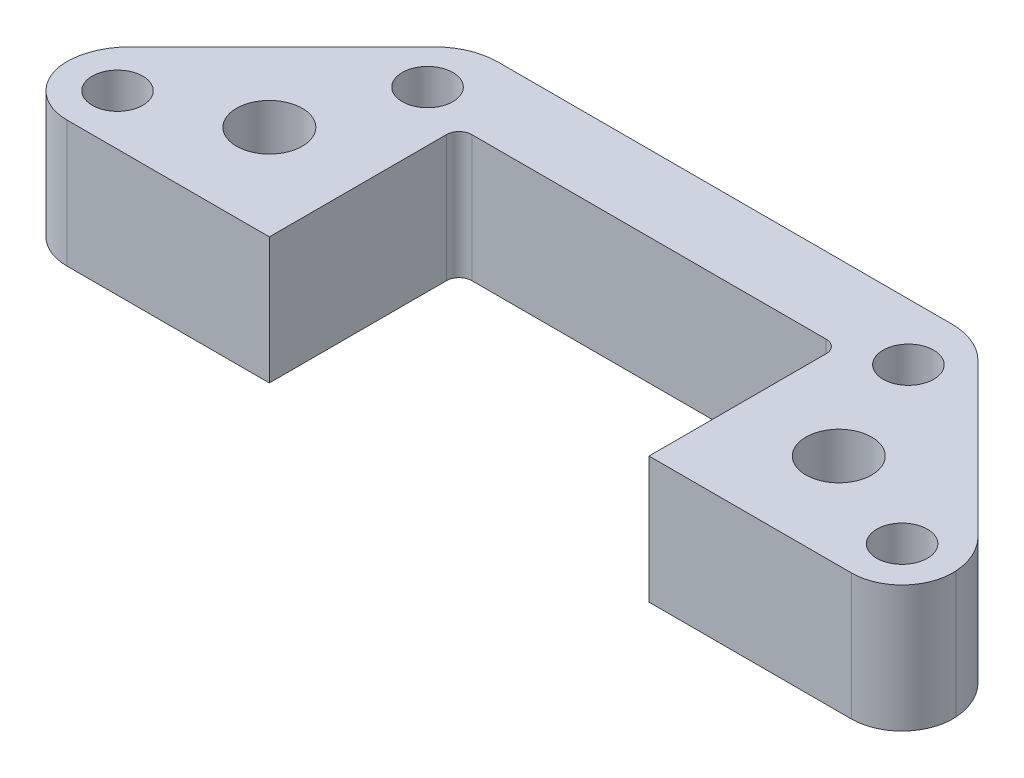
ISO-10303-21;
HEADER;
FILE_DESCRIPTION(('STEP AP214'),'2;1');
FILE_NAME('part.step','',(''),(''),'','','');
FILE_SCHEMA(('AUTOMOTIVE_DESIGN { 1 0 10303 214 1 1 1 1 }'));
ENDSEC;
DATA;
#1=APPLICATION_CONTEXT('core data for automotive mechanical design processes');
#2=APPLICATION_PROTOCOL_DEFINITION('international standard','automotive_design',2000,#1);
#3=PRODUCT_CONTEXT('',#1,'mechanical');
#4=PRODUCT('Part','Part','',(#3));
#5=PRODUCT_RELATED_PRODUCT_CATEGORY('part','',(#4));
#6=PRODUCT_DEFINITION_FORMATION('','',#4);
#7=PRODUCT_DEFINITION_CONTEXT('part definition',#1,'design');
#8=PRODUCT_DEFINITION('design','',#6,#7);
#9=PRODUCT_DEFINITION_SHAPE('','',#8);
#10=(LENGTH_UNIT() NAMED_UNIT(*) SI_UNIT(.MILLI.,.METRE.));
#11=(NAMED_UNIT(*) PLANE_ANGLE_UNIT() SI_UNIT($,.RADIAN.));
#12=(NAMED_UNIT(*) SI_UNIT($,.STERADIAN.) SOLID_ANGLE_UNIT());
#13=UNCERTAINTY_MEASURE_WITH_UNIT(LENGTH_MEASURE(1.E-05),#10,'distance_accuracy_value','');
#14=(GEOMETRIC_REPRESENTATION_CONTEXT(3) GLOBAL_UNCERTAINTY_ASSIGNED_CONTEXT((#13)) GLOBAL_UNIT_ASSIGNED_CONTEXT((#10,
#11,#12)) REPRESENTATION_CONTEXT('',''));
#15=CARTESIAN_POINT('',(0.,0.,0.));
#16=DIRECTION('',(0.,0.,1.));
#17=DIRECTION('',(1.,0.,0.));
#18=AXIS2_PLACEMENT_3D('',#15,#16,#17);
#19=CARTESIAN_POINT('',(22.5,10.,-7.5));
#20=DIRECTION('',(0.,-1.,0.));
#21=DIRECTION('',(0.,0.,-1.));
#22=AXIS2_PLACEMENT_3D('',#19,#20,#21);
#23=CYLINDRICAL_SURFACE('',#22,2.6);
#24=CARTESIAN_POINT('',(22.5,10.,-7.5));
#25=DIRECTION('',(0.,1.,0.));
#26=DIRECTION('',(0.,0.,1.));
#27=AXIS2_PLACEMENT_3D('',#24,#25,#26);
#28=CIRCLE('',#27,2.6);
#29=CARTESIAN_POINT('',(22.5,10.,-4.9));
#30=VERTEX_POINT('',#29);
#31=EDGE_CURVE('E220',#30,#30,#28,.T.);
#32=ORIENTED_EDGE('',*,*,#31,.T.);
#33=EDGE_LOOP('',(#32));
#34=FACE_BOUND('',#33,.T.);
#35=CARTESIAN_POINT('',(22.5,5.4,-7.5));
#36=DIRECTION('',(0.,-1.,0.));
#37=DIRECTION('',(0.,0.,-1.));
#38=AXIS2_PLACEMENT_3D('',#35,#36,#37);
#39=CIRCLE('',#38,2.6);
#40=CARTESIAN_POINT('',(22.5,5.4,-10.1));
#41=VERTEX_POINT('',#40);
#42=EDGE_CURVE('E213',#41,#41,#39,.T.);
#43=ORIENTED_EDGE('',*,*,#42,.T.);
#44=EDGE_LOOP('',(#43));
#45=FACE_BOUND('',#44,.T.);
#46=ADVANCED_FACE('F41',(#34,#45),#23,.F.);
#47=CARTESIAN_POINT('',(0.,10.,0.));
#48=DIRECTION('',(0.,1.,0.));
#49=DIRECTION('',(0.,0.,1.));
#50=AXIS2_PLACEMENT_3D('',#47,#48,#49);
#51=PLANE('',#50);
#52=DIRECTION('',(1.,0.,0.));
#53=VECTOR('',#52,1.);
#54=CARTESIAN_POINT('',(15.,10.,0.));
#55=LINE('',#54,#53);
#56=CARTESIAN_POINT('',(15.,10.,0.));
#57=VERTEX_POINT('',#56);
#58=CARTESIAN_POINT('',(30.9974714863677,10.,0.));
#59=VERTEX_POINT('',#58);
#60=EDGE_CURVE('E282',#57,#59,#55,.T.);
#61=ORIENTED_EDGE('',*,*,#60,.T.);
#62=CARTESIAN_POINT('',(30.9974714863677,10.,-4.00000000000001));
#63=DIRECTION('',(0.,1.,0.));
#64=DIRECTION('',(0.,0.,1.));
#65=AXIS2_PLACEMENT_3D('',#62,#63,#64);
#66=CIRCLE('',#65,4.);
#67=CARTESIAN_POINT('',(34.9873574318387,10.,-4.28427124746191));
#68=VERTEX_POINT('',#67);
#69=EDGE_CURVE('E261',#59,#68,#66,.T.);
#70=ORIENTED_EDGE('',*,*,#69,.T.);
#71=CARTESIAN_POINT('',(30.,10.,-3.92893218813454));
#72=DIRECTION('',(0.,1.,0.));
#73=DIRECTION('',(0.,0.,1.));
#74=AXIS2_PLACEMENT_3D('',#71,#72,#73);
#75=CIRCLE('',#74,5.);
#76=CARTESIAN_POINT('',(33.5355339059327,10.,-7.46446609406727));
#77=VERTEX_POINT('',#76);
#78=EDGE_CURVE('E239',#68,#77,#75,.T.);
#79=ORIENTED_EDGE('',*,*,#78,.T.);
#80=DIRECTION('',(-0.707106781186548,0.,-0.707106781186547));
#81=VECTOR('',#80,1.);
#82=CARTESIAN_POINT('',(20.,10.,-21.));
#83=LINE('',#82,#81);
#84=CARTESIAN_POINT('',(21.4644660940673,10.,-19.5355339059327));
#85=VERTEX_POINT('',#84);
#86=EDGE_CURVE('E279',#77,#85,#83,.T.);
#87=ORIENTED_EDGE('',*,*,#86,.T.);
#88=CARTESIAN_POINT('',(17.9289321881345,10.,-16.));
#89=DIRECTION('',(0.,1.,0.));
#90=DIRECTION('',(0.,0.,1.));
#91=AXIS2_PLACEMENT_3D('',#88,#89,#90);
#92=CIRCLE('',#91,5.);
#93=CARTESIAN_POINT('',(17.9289321881345,10.,-21.));
#94=VERTEX_POINT('',#93);
#95=EDGE_CURVE('E237',#85,#94,#92,.T.);
#96=ORIENTED_EDGE('',*,*,#95,.T.);
#97=DIRECTION('',(-1.,0.,0.));
#98=VECTOR('',#97,1.);
#99=CARTESIAN_POINT('',(-20.,10.,-21.));
#100=LINE('',#99,#98);
#101=CARTESIAN_POINT('',(-17.9289321881345,10.,-21.));
#102=VERTEX_POINT('',#101);
#103=EDGE_CURVE('E276',#94,#102,#100,.T.);
#104=ORIENTED_EDGE('',*,*,#103,.T.);
#105=CARTESIAN_POINT('',(-17.9289321881345,10.,-16.));
#106=DIRECTION('',(0.,1.,0.));
#107=DIRECTION('',(0.,0.,1.));
#108=AXIS2_PLACEMENT_3D('',#105,#106,#107);
#109=CIRCLE('',#108,5.);
#110=CARTESIAN_POINT('',(-21.4644660940673,10.,-19.5355339059327));
#111=VERTEX_POINT('',#110);
#112=EDGE_CURVE('E233',#102,#111,#109,.T.);
#113=ORIENTED_EDGE('',*,*,#112,.T.);
#114=DIRECTION('',(-0.707106781186548,0.,0.707106781186547));
#115=VECTOR('',#114,1.);
#116=CARTESIAN_POINT('',(-20.,10.,-21.));
#117=LINE('',#116,#115);
#118=CARTESIAN_POINT('',(-33.5355339059327,10.,-7.46446609406726));
#119=VERTEX_POINT('',#118);
#120=EDGE_CURVE('E204',#111,#119,#117,.T.);
#121=ORIENTED_EDGE('',*,*,#120,.T.);
#122=CARTESIAN_POINT('',(-30.,10.,-3.92893218813452));
#123=DIRECTION('',(0.,1.,0.));
#124=DIRECTION('',(0.,0.,1.));
#125=AXIS2_PLACEMENT_3D('',#122,#123,#124);
#126=CIRCLE('',#125,5.);
#127=CARTESIAN_POINT('',(-34.9873574318387,10.,-4.28427124746191));
#128=VERTEX_POINT('',#127);
#129=EDGE_CURVE('E235',#119,#128,#126,.T.);
#130=ORIENTED_EDGE('',*,*,#129,.T.);
#131=CARTESIAN_POINT('',(-30.9974714863677,10.,-4.));
#132=DIRECTION('',(0.,1.,0.));
#133=DIRECTION('',(0.,0.,1.));
#134=AXIS2_PLACEMENT_3D('',#131,#132,#133);
#135=CIRCLE('',#134,4.);
#136=CARTESIAN_POINT('',(-30.9974714863677,10.,0.));
#137=VERTEX_POINT('',#136);
#138=EDGE_CURVE('E56',#128,#137,#135,.T.);
#139=ORIENTED_EDGE('',*,*,#138,.T.);
#140=DIRECTION('',(1.,0.,0.));
#141=VECTOR('',#140,1.);
#142=CARTESIAN_POINT('',(-15.,10.,0.));
#143=LINE('',#142,#141);
#144=CARTESIAN_POINT('',(-15.,10.,0.));
#145=VERTEX_POINT('',#144);
#146=EDGE_CURVE('E200',#137,#145,#143,.T.);
#147=ORIENTED_EDGE('',*,*,#146,.T.);
#148=DIRECTION('',(0.,0.,-1.));
#149=VECTOR('',#148,1.);
#150=CARTESIAN_POINT('',(-15.,10.,-14.));
#151=LINE('',#150,#149);
#152=CARTESIAN_POINT('',(-15.,10.,-14.));
#153=VERTEX_POINT('',#152);
#154=EDGE_CURVE('E289',#145,#153,#151,.T.);
#155=ORIENTED_EDGE('',*,*,#154,.T.);
#156=CARTESIAN_POINT('',(-14.,10.,-14.));
#157=DIRECTION('',(0.,1.,0.));
#158=DIRECTION('',(0.,0.,-1.));
#159=AXIS2_PLACEMENT_3D('',#156,#157,#158);
#160=CIRCLE('',#159,0.999999999999991);
#161=CARTESIAN_POINT('',(-14.,10.,-15.));
#162=VERTEX_POINT('',#161);
#163=EDGE_CURVE('E331',#162,#153,#160,.T.);
#164=ORIENTED_EDGE('',*,*,#163,.F.);
#165=DIRECTION('',(1.,0.,0.));
#166=VECTOR('',#165,1.);
#167=CARTESIAN_POINT('',(-14.,10.,-15.));
#168=LINE('',#167,#166);
#169=CARTESIAN_POINT('',(14.,10.,-15.));
#170=VERTEX_POINT('',#169);
#171=EDGE_CURVE('E287',#162,#170,#168,.T.);
#172=ORIENTED_EDGE('',*,*,#171,.T.);
#173=CARTESIAN_POINT('',(14.,10.,-14.));
#174=DIRECTION('',(0.,1.,0.));
#175=DIRECTION('',(0.,0.,1.));
#176=AXIS2_PLACEMENT_3D('',#173,#174,#175);
#177=CIRCLE('',#176,0.999999999999991);
#178=CARTESIAN_POINT('',(15.,10.,-14.));
#179=VERTEX_POINT('',#178);
#180=EDGE_CURVE('E159',#179,#170,#177,.T.);
#181=ORIENTED_EDGE('',*,*,#180,.F.);
#182=DIRECTION('',(0.,0.,1.));
#183=VECTOR('',#182,1.);
#184=CARTESIAN_POINT('',(15.,10.,-14.));
#185=LINE('',#184,#183);
#186=EDGE_CURVE('E285',#179,#57,#185,.T.);
#187=ORIENTED_EDGE('',*,*,#186,.T.);
#188=EDGE_LOOP('',(#61,#70,#79,#87,#96,#104,#113,#121,#130,#139,#147,#155,#164,#172,#181,#187));
#189=FACE_BOUND('',#188,.T.);
#190=CARTESIAN_POINT('',(31.,10.,-4.));
#191=DIRECTION('',(0.,1.,0.));
#192=DIRECTION('',(0.,0.,1.));
#193=AXIS2_PLACEMENT_3D('',#190,#191,#192);
#194=CIRCLE('',#193,2.);
#195=CARTESIAN_POINT('',(31.,10.,-2.));
#196=VERTEX_POINT('',#195);
#197=EDGE_CURVE('E176',#196,#196,#194,.F.);
#198=ORIENTED_EDGE('',*,*,#197,.T.);
#199=EDGE_LOOP('',(#198));
#200=FACE_BOUND('',#199,.T.);
#201=CARTESIAN_POINT('',(-31.,10.,-4.));
#202=DIRECTION('',(0.,1.,0.));
#203=DIRECTION('',(0.,0.,1.));
#204=AXIS2_PLACEMENT_3D('',#201,#202,#203);
#205=CIRCLE('',#204,2.);
#206=CARTESIAN_POINT('',(-31.,10.,-2.));
#207=VERTEX_POINT('',#206);
#208=EDGE_CURVE('E316',#207,#207,#205,.F.);
#209=ORIENTED_EDGE('',*,*,#208,.T.);
#210=EDGE_LOOP('',(#209));
#211=FACE_BOUND('',#210,.T.);
#212=CARTESIAN_POINT('',(-19.,10.,-16.5));
#213=DIRECTION('',(0.,1.,0.));
#214=DIRECTION('',(0.,0.,1.));
#215=AXIS2_PLACEMENT_3D('',#212,#213,#214);
#216=CIRCLE('',#215,2.);
#217=CARTESIAN_POINT('',(-19.,10.,-14.5));
#218=VERTEX_POINT('',#217);
#219=EDGE_CURVE('E322',#218,#218,#216,.F.);
#220=ORIENTED_EDGE('',*,*,#219,.T.);
#221=EDGE_LOOP('',(#220));
#222=FACE_BOUND('',#221,.T.);
#223=CARTESIAN_POINT('',(19.,10.,-16.5));
#224=DIRECTION('',(0.,1.,0.));
#225=DIRECTION('',(0.,0.,1.));
#226=AXIS2_PLACEMENT_3D('',#223,#224,#225);
#227=CIRCLE('',#226,2.);
#228=CARTESIAN_POINT('',(19.,10.,-14.5));
#229=VERTEX_POINT('',#228);
#230=EDGE_CURVE('E299',#229,#229,#227,.F.);
#231=ORIENTED_EDGE('',*,*,#230,.T.);
#232=EDGE_LOOP('',(#231));
#233=FACE_BOUND('',#232,.T.);
#234=CARTESIAN_POINT('',(-22.5,10.,-7.5));
#235=DIRECTION('',(0.,1.,0.));
#236=DIRECTION('',(0.,0.,1.));
#237=AXIS2_PLACEMENT_3D('',#234,#235,#236);
#238=CIRCLE('',#237,2.6);
#239=CARTESIAN_POINT('',(-22.5,10.,-4.9));
#240=VERTEX_POINT('',#239);
#241=EDGE_CURVE('E270',#240,#240,#238,.T.);
#242=ORIENTED_EDGE('',*,*,#241,.F.);
#243=EDGE_LOOP('',(#242));
#244=FACE_BOUND('',#243,.T.);
#245=ORIENTED_EDGE('',*,*,#31,.F.);
#246=EDGE_LOOP('',(#245));
#247=FACE_BOUND('',#246,.T.);
#248=ADVANCED_FACE('F338',(#189,#200,#211,#222,#233,#244,#247),#51,.T.);
#249=CARTESIAN_POINT('',(0.,0.,0.));
#250=DIRECTION('',(0.,1.,0.));
#251=DIRECTION('',(0.,0.,1.));
#252=AXIS2_PLACEMENT_3D('',#249,#250,#251);
#253=PLANE('',#252);
#254=CARTESIAN_POINT('',(31.,0.,-4.));
#255=DIRECTION('',(0.,-1.,0.));
#256=DIRECTION('',(0.,0.,-1.));
#257=AXIS2_PLACEMENT_3D('',#254,#255,#256);
#258=CIRCLE('',#257,2.);
#259=CARTESIAN_POINT('',(31.,0.,-6.00000000000001));
#260=VERTEX_POINT('',#259);
#261=EDGE_CURVE('E313',#260,#260,#258,.T.);
#262=ORIENTED_EDGE('',*,*,#261,.F.);
#263=EDGE_LOOP('',(#262));
#264=FACE_BOUND('',#263,.T.);
#265=CARTESIAN_POINT('',(-31.,0.,-4.));
#266=DIRECTION('',(0.,-1.,0.));
#267=DIRECTION('',(0.,0.,-1.));
#268=AXIS2_PLACEMENT_3D('',#265,#266,#267);
#269=CIRCLE('',#268,2.);
#270=CARTESIAN_POINT('',(-31.,0.,-6.00000000000001));
#271=VERTEX_POINT('',#270);
#272=EDGE_CURVE('E319',#271,#271,#269,.T.);
#273=ORIENTED_EDGE('',*,*,#272,.F.);
#274=EDGE_LOOP('',(#273));
#275=FACE_BOUND('',#274,.T.);
#276=CARTESIAN_POINT('',(-19.,0.,-16.5));
#277=DIRECTION('',(0.,-1.,0.));
#278=DIRECTION('',(0.,0.,-1.));
#279=AXIS2_PLACEMENT_3D('',#276,#277,#278);
#280=CIRCLE('',#279,2.);
#281=CARTESIAN_POINT('',(-19.,0.,-18.5));
#282=VERTEX_POINT('',#281);
#283=EDGE_CURVE('E312',#282,#282,#280,.T.);
#284=ORIENTED_EDGE('',*,*,#283,.F.);
#285=EDGE_LOOP('',(#284));
#286=FACE_BOUND('',#285,.T.);
#287=CARTESIAN_POINT('',(19.,0.,-16.5));
#288=DIRECTION('',(0.,-1.,0.));
#289=DIRECTION('',(0.,0.,-1.));
#290=AXIS2_PLACEMENT_3D('',#287,#288,#289);
#291=CIRCLE('',#290,2.);
#292=CARTESIAN_POINT('',(19.,0.,-18.5));
#293=VERTEX_POINT('',#292);
#294=EDGE_CURVE('E309',#293,#293,#291,.T.);
#295=ORIENTED_EDGE('',*,*,#294,.F.);
#296=EDGE_LOOP('',(#295));
#297=FACE_BOUND('',#296,.T.);
#298=CARTESIAN_POINT('',(22.5,0.,-7.5));
#299=DIRECTION('',(0.,-1.,0.));
#300=DIRECTION('',(0.,0.,-1.));
#301=AXIS2_PLACEMENT_3D('',#298,#299,#300);
#302=CIRCLE('',#301,5.1);
#303=CARTESIAN_POINT('',(22.5,0.,-12.6));
#304=VERTEX_POINT('',#303);
#305=EDGE_CURVE('E302',#304,#304,#302,.T.);
#306=ORIENTED_EDGE('',*,*,#305,.F.);
#307=EDGE_LOOP('',(#306));
#308=FACE_BOUND('',#307,.T.);
#309=CARTESIAN_POINT('',(-22.5,0.,-7.5));
#310=DIRECTION('',(0.,-1.,0.));
#311=DIRECTION('',(0.,0.,1.));
#312=AXIS2_PLACEMENT_3D('',#309,#310,#311);
#313=CIRCLE('',#312,5.1);
#314=CARTESIAN_POINT('',(-22.5,0.,-2.4));
#315=VERTEX_POINT('',#314);
#316=EDGE_CURVE('E298',#315,#315,#313,.T.);
#317=ORIENTED_EDGE('',*,*,#316,.F.);
#318=EDGE_LOOP('',(#317));
#319=FACE_BOUND('',#318,.T.);
#320=CARTESIAN_POINT('',(30.,0.,-3.92893218813454));
#321=DIRECTION('',(0.,1.,0.));
#322=DIRECTION('',(0.,0.,1.));
#323=AXIS2_PLACEMENT_3D('',#320,#321,#322);
#324=CIRCLE('',#323,5.);
#325=CARTESIAN_POINT('',(33.5355339059327,0.,-7.46446609406727));
#326=VERTEX_POINT('',#325);
#327=CARTESIAN_POINT('',(34.9873574318387,0.,-4.28427124746191));
#328=VERTEX_POINT('',#327);
#329=EDGE_CURVE('E231',#326,#328,#324,.F.);
#330=ORIENTED_EDGE('',*,*,#329,.T.);
#331=CARTESIAN_POINT('',(30.9974714863677,0.,-4.00000000000001));
#332=DIRECTION('',(0.,1.,0.));
#333=DIRECTION('',(0.,0.,1.));
#334=AXIS2_PLACEMENT_3D('',#331,#332,#333);
#335=CIRCLE('',#334,4.);
#336=CARTESIAN_POINT('',(30.9974714863677,0.,0.));
#337=VERTEX_POINT('',#336);
#338=EDGE_CURVE('E256',#328,#337,#335,.F.);
#339=ORIENTED_EDGE('',*,*,#338,.T.);
#340=DIRECTION('',(1.,0.,0.));
#341=VECTOR('',#340,1.);
#342=CARTESIAN_POINT('',(15.,0.,0.));
#343=LINE('',#342,#341);
#344=CARTESIAN_POINT('',(15.,0.,0.));
#345=VERTEX_POINT('',#344);
#346=EDGE_CURVE('E182',#345,#337,#343,.T.);
#347=ORIENTED_EDGE('',*,*,#346,.F.);
#348=DIRECTION('',(0.,0.,1.));
#349=VECTOR('',#348,1.);
#350=CARTESIAN_POINT('',(15.,0.,-14.));
#351=LINE('',#350,#349);
#352=CARTESIAN_POINT('',(15.,0.,-14.));
#353=VERTEX_POINT('',#352);
#354=EDGE_CURVE('E175',#353,#345,#351,.T.);
#355=ORIENTED_EDGE('',*,*,#354,.F.);
#356=CARTESIAN_POINT('',(14.,0.,-14.));
#357=DIRECTION('',(0.,1.,0.));
#358=DIRECTION('',(0.,0.,1.));
#359=AXIS2_PLACEMENT_3D('',#356,#357,#358);
#360=CIRCLE('',#359,0.999999999999991);
#361=CARTESIAN_POINT('',(14.,0.,-15.));
#362=VERTEX_POINT('',#361);
#363=EDGE_CURVE('E156',#353,#362,#360,.T.);
#364=ORIENTED_EDGE('',*,*,#363,.T.);
#365=DIRECTION('',(1.,0.,0.));
#366=VECTOR('',#365,1.);
#367=CARTESIAN_POINT('',(-14.,0.,-15.));
#368=LINE('',#367,#366);
#369=CARTESIAN_POINT('',(-14.,0.,-15.));
#370=VERTEX_POINT('',#369);
#371=EDGE_CURVE('E173',#370,#362,#368,.T.);
#372=ORIENTED_EDGE('',*,*,#371,.F.);
#373=CARTESIAN_POINT('',(-14.,0.,-14.));
#374=DIRECTION('',(0.,1.,0.));
#375=DIRECTION('',(0.,0.,-1.));
#376=AXIS2_PLACEMENT_3D('',#373,#374,#375);
#377=CIRCLE('',#376,0.999999999999991);
#378=CARTESIAN_POINT('',(-15.,0.,-14.));
#379=VERTEX_POINT('',#378);
#380=EDGE_CURVE('E329',#370,#379,#377,.T.);
#381=ORIENTED_EDGE('',*,*,#380,.T.);
#382=DIRECTION('',(0.,0.,-1.));
#383=VECTOR('',#382,1.);
#384=CARTESIAN_POINT('',(-15.,0.,-14.));
#385=LINE('',#384,#383);
#386=CARTESIAN_POINT('',(-15.,0.,0.));
#387=VERTEX_POINT('',#386);
#388=EDGE_CURVE('E180',#387,#379,#385,.T.);
#389=ORIENTED_EDGE('',*,*,#388,.F.);
#390=DIRECTION('',(1.,0.,0.));
#391=VECTOR('',#390,1.);
#392=CARTESIAN_POINT('',(-15.,0.,0.));
#393=LINE('',#392,#391);
#394=CARTESIAN_POINT('',(-30.9974714863677,0.,0.));
#395=VERTEX_POINT('',#394);
#396=EDGE_CURVE('E185',#395,#387,#393,.T.);
#397=ORIENTED_EDGE('',*,*,#396,.F.);
#398=CARTESIAN_POINT('',(-30.9974714863677,0.,-4.));
#399=DIRECTION('',(0.,1.,0.));
#400=DIRECTION('',(0.,0.,1.));
#401=AXIS2_PLACEMENT_3D('',#398,#399,#400);
#402=CIRCLE('',#401,4.);
#403=CARTESIAN_POINT('',(-34.9873574318387,0.,-4.28427124746191));
#404=VERTEX_POINT('',#403);
#405=EDGE_CURVE('E254',#395,#404,#402,.F.);
#406=ORIENTED_EDGE('',*,*,#405,.T.);
#407=CARTESIAN_POINT('',(-30.,0.,-3.92893218813452));
#408=DIRECTION('',(0.,1.,0.));
#409=DIRECTION('',(0.,0.,1.));
#410=AXIS2_PLACEMENT_3D('',#407,#408,#409);
#411=CIRCLE('',#410,5.);
#412=CARTESIAN_POINT('',(-33.5355339059327,0.,-7.46446609406726));
#413=VERTEX_POINT('',#412);
#414=EDGE_CURVE('E227',#404,#413,#411,.F.);
#415=ORIENTED_EDGE('',*,*,#414,.T.);
#416=DIRECTION('',(-0.707106781186548,0.,0.707106781186547));
#417=VECTOR('',#416,1.);
#418=CARTESIAN_POINT('',(-20.,0.,-21.));
#419=LINE('',#418,#417);
#420=CARTESIAN_POINT('',(-21.4644660940673,0.,-19.5355339059327));
#421=VERTEX_POINT('',#420);
#422=EDGE_CURVE('E197',#421,#413,#419,.T.);
#423=ORIENTED_EDGE('',*,*,#422,.F.);
#424=CARTESIAN_POINT('',(-17.9289321881345,0.,-16.));
#425=DIRECTION('',(0.,1.,0.));
#426=DIRECTION('',(0.,0.,1.));
#427=AXIS2_PLACEMENT_3D('',#424,#425,#426);
#428=CIRCLE('',#427,5.);
#429=CARTESIAN_POINT('',(-17.9289321881345,0.,-21.));
#430=VERTEX_POINT('',#429);
#431=EDGE_CURVE('E225',#421,#430,#428,.F.);
#432=ORIENTED_EDGE('',*,*,#431,.T.);
#433=DIRECTION('',(-1.,0.,0.));
#434=VECTOR('',#433,1.);
#435=CARTESIAN_POINT('',(-20.,0.,-21.));
#436=LINE('',#435,#434);
#437=CARTESIAN_POINT('',(17.9289321881345,0.,-21.));
#438=VERTEX_POINT('',#437);
#439=EDGE_CURVE('E194',#438,#430,#436,.T.);
#440=ORIENTED_EDGE('',*,*,#439,.F.);
#441=CARTESIAN_POINT('',(17.9289321881345,0.,-16.));
#442=DIRECTION('',(0.,1.,0.));
#443=DIRECTION('',(0.,0.,1.));
#444=AXIS2_PLACEMENT_3D('',#441,#442,#443);
#445=CIRCLE('',#444,5.);
#446=CARTESIAN_POINT('',(21.4644660940673,0.,-19.5355339059327));
#447=VERTEX_POINT('',#446);
#448=EDGE_CURVE('E229',#438,#447,#445,.F.);
#449=ORIENTED_EDGE('',*,*,#448,.T.);
#450=DIRECTION('',(-0.707106781186548,0.,-0.707106781186547));
#451=VECTOR('',#450,1.);
#452=CARTESIAN_POINT('',(20.,0.,-21.));
#453=LINE('',#452,#451);
#454=EDGE_CURVE('E191',#326,#447,#453,.T.);
#455=ORIENTED_EDGE('',*,*,#454,.F.);
#456=EDGE_LOOP('',(#330,#339,#347,#355,#364,#372,#381,#389,#397,#406,#415,#423,#432,#440,#449,#455));
#457=FACE_BOUND('',#456,.T.);
#458=ADVANCED_FACE('F171',(#264,#275,#286,#297,#308,#319,#457),#253,.F.);
#459=CARTESIAN_POINT('',(-15.,10.,0.));
#460=DIRECTION('',(0.,0.,-1.));
#461=DIRECTION('',(-1.,0.,0.));
#462=AXIS2_PLACEMENT_3D('',#459,#460,#461);
#463=PLANE('',#462);
#464=ORIENTED_EDGE('',*,*,#146,.F.);
#465=DIRECTION('',(0.,1.,0.));
#466=VECTOR('',#465,1.);
#467=CARTESIAN_POINT('',(-30.9974714863677,0.,0.));
#468=LINE('',#467,#466);
#469=EDGE_CURVE('E49',#137,#395,#468,.F.);
#470=ORIENTED_EDGE('',*,*,#469,.T.);
#471=ORIENTED_EDGE('',*,*,#396,.T.);
#472=DIRECTION('',(0.,-1.,0.));
#473=VECTOR('',#472,1.);
#474=CARTESIAN_POINT('',(-15.,10.,0.));
#475=LINE('',#474,#473);
#476=EDGE_CURVE('E209',#145,#387,#475,.T.);
#477=ORIENTED_EDGE('',*,*,#476,.F.);
#478=EDGE_LOOP('',(#464,#470,#471,#477));
#479=FACE_BOUND('',#478,.T.);
#480=ADVANCED_FACE('F266',(#479),#463,.F.);
#481=CARTESIAN_POINT('',(-15.,10.,-14.));
#482=DIRECTION('',(-1.,0.,0.));
#483=DIRECTION('',(0.,0.,1.));
#484=AXIS2_PLACEMENT_3D('',#481,#482,#483);
#485=PLANE('',#484);
#486=ORIENTED_EDGE('',*,*,#388,.T.);
#487=DIRECTION('',(0.,-1.,0.));
#488=VECTOR('',#487,1.);
#489=CARTESIAN_POINT('',(-15.,10.,-14.));
#490=LINE('',#489,#488);
#491=EDGE_CURVE('E207',#153,#379,#490,.T.);
#492=ORIENTED_EDGE('',*,*,#491,.F.);
#493=ORIENTED_EDGE('',*,*,#154,.F.);
#494=ORIENTED_EDGE('',*,*,#476,.T.);
#495=EDGE_LOOP('',(#486,#492,#493,#494));
#496=FACE_BOUND('',#495,.T.);
#497=ADVANCED_FACE('F341',(#496),#485,.F.);
#498=CARTESIAN_POINT('',(-14.,10.,-15.));
#499=DIRECTION('',(0.,0.,-1.));
#500=DIRECTION('',(-1.,0.,0.));
#501=AXIS2_PLACEMENT_3D('',#498,#499,#500);
#502=PLANE('',#501);
#503=ORIENTED_EDGE('',*,*,#371,.T.);
#504=DIRECTION('',(0.,-1.,0.));
#505=VECTOR('',#504,1.);
#506=CARTESIAN_POINT('',(14.,10.,-15.));
#507=LINE('',#506,#505);
#508=EDGE_CURVE('E153',#170,#362,#507,.T.);
#509=ORIENTED_EDGE('',*,*,#508,.F.);
#510=ORIENTED_EDGE('',*,*,#171,.F.);
#511=DIRECTION('',(0.,-1.,0.));
#512=VECTOR('',#511,1.);
#513=CARTESIAN_POINT('',(-14.,10.,-15.));
#514=LINE('',#513,#512);
#515=EDGE_CURVE('E164',#162,#370,#514,.T.);
#516=ORIENTED_EDGE('',*,*,#515,.T.);
#517=EDGE_LOOP('',(#503,#509,#510,#516));
#518=FACE_BOUND('',#517,.T.);
#519=ADVANCED_FACE('F179',(#518),#502,.F.);
#520=CARTESIAN_POINT('',(15.,10.,-14.));
#521=DIRECTION('',(1.,0.,0.));
#522=DIRECTION('',(0.,0.,-1.));
#523=AXIS2_PLACEMENT_3D('',#520,#521,#522);
#524=PLANE('',#523);
#525=ORIENTED_EDGE('',*,*,#354,.T.);
#526=DIRECTION('',(0.,-1.,0.));
#527=VECTOR('',#526,1.);
#528=CARTESIAN_POINT('',(15.,10.,0.));
#529=LINE('',#528,#527);
#530=EDGE_CURVE('E201',#57,#345,#529,.T.);
#531=ORIENTED_EDGE('',*,*,#530,.F.);
#532=ORIENTED_EDGE('',*,*,#186,.F.);
#533=DIRECTION('',(0.,-1.,0.));
#534=VECTOR('',#533,1.);
#535=CARTESIAN_POINT('',(15.,10.,-14.));
#536=LINE('',#535,#534);
#537=EDGE_CURVE('E165',#179,#353,#536,.T.);
#538=ORIENTED_EDGE('',*,*,#537,.T.);
#539=EDGE_LOOP('',(#525,#531,#532,#538));
#540=FACE_BOUND('',#539,.T.);
#541=ADVANCED_FACE('F348',(#540),#524,.F.);
#542=CARTESIAN_POINT('',(15.,10.,0.));
#543=DIRECTION('',(0.,0.,-1.));
#544=DIRECTION('',(-1.,0.,0.));
#545=AXIS2_PLACEMENT_3D('',#542,#543,#544);
#546=PLANE('',#545);
#547=ORIENTED_EDGE('',*,*,#346,.T.);
#548=DIRECTION('',(0.,1.,0.));
#549=VECTOR('',#548,1.);
#550=CARTESIAN_POINT('',(30.9974714863677,10.,0.));
#551=LINE('',#550,#549);
#552=EDGE_CURVE('E258',#337,#59,#551,.T.);
#553=ORIENTED_EDGE('',*,*,#552,.T.);
#554=ORIENTED_EDGE('',*,*,#60,.F.);
#555=ORIENTED_EDGE('',*,*,#530,.T.);
#556=EDGE_LOOP('',(#547,#553,#554,#555));
#557=FACE_BOUND('',#556,.T.);
#558=ADVANCED_FACE('F383',(#557),#546,.F.);
#559=CARTESIAN_POINT('',(20.,10.,-21.));
#560=DIRECTION('',(-0.707106781186547,0.,0.707106781186548));
#561=DIRECTION('',(0.707106781186548,0.,0.707106781186547));
#562=AXIS2_PLACEMENT_3D('',#559,#560,#561);
#563=PLANE('',#562);
#564=ORIENTED_EDGE('',*,*,#86,.F.);
#565=DIRECTION('',(0.,-1.,0.));
#566=VECTOR('',#565,1.);
#567=CARTESIAN_POINT('',(33.5355339059327,10.,-7.46446609406727));
#568=LINE('',#567,#566);
#569=EDGE_CURVE('E222',#77,#326,#568,.T.);
#570=ORIENTED_EDGE('',*,*,#569,.T.);
#571=ORIENTED_EDGE('',*,*,#454,.T.);
#572=DIRECTION('',(0.,-1.,0.));
#573=VECTOR('',#572,1.);
#574=CARTESIAN_POINT('',(21.4644660940673,10.,-19.5355339059327));
#575=LINE('',#574,#573);
#576=EDGE_CURVE('E212',#447,#85,#575,.F.);
#577=ORIENTED_EDGE('',*,*,#576,.T.);
#578=EDGE_LOOP('',(#564,#570,#571,#577));
#579=FACE_BOUND('',#578,.T.);
#580=ADVANCED_FACE('F379',(#579),#563,.F.);
#581=CARTESIAN_POINT('',(-20.,10.,-21.));
#582=DIRECTION('',(0.,0.,1.));
#583=DIRECTION('',(1.,0.,0.));
#584=AXIS2_PLACEMENT_3D('',#581,#582,#583);
#585=PLANE('',#584);
#586=ORIENTED_EDGE('',*,*,#103,.F.);
#587=DIRECTION('',(0.,-1.,0.));
#588=VECTOR('',#587,1.);
#589=CARTESIAN_POINT('',(17.9289321881345,10.,-21.));
#590=LINE('',#589,#588);
#591=EDGE_CURVE('E243',#94,#438,#590,.T.);
#592=ORIENTED_EDGE('',*,*,#591,.T.);
#593=ORIENTED_EDGE('',*,*,#439,.T.);
#594=DIRECTION('',(0.,-1.,0.));
#595=VECTOR('',#594,1.);
#596=CARTESIAN_POINT('',(-17.9289321881345,10.,-21.));
#597=LINE('',#596,#595);
#598=EDGE_CURVE('E241',#430,#102,#597,.F.);
#599=ORIENTED_EDGE('',*,*,#598,.T.);
#600=EDGE_LOOP('',(#586,#592,#593,#599));
#601=FACE_BOUND('',#600,.T.);
#602=ADVANCED_FACE('F375',(#601),#585,.F.);
#603=CARTESIAN_POINT('',(-20.,10.,-21.));
#604=DIRECTION('',(0.707106781186547,0.,0.707106781186548));
#605=DIRECTION('',(0.707106781186548,0.,-0.707106781186547));
#606=AXIS2_PLACEMENT_3D('',#603,#604,#605);
#607=PLANE('',#606);
#608=ORIENTED_EDGE('',*,*,#422,.T.);
#609=DIRECTION('',(0.,-1.,0.));
#610=VECTOR('',#609,1.);
#611=CARTESIAN_POINT('',(-33.5355339059327,10.,-7.46446609406726));
#612=LINE('',#611,#610);
#613=EDGE_CURVE('E249',#413,#119,#612,.F.);
#614=ORIENTED_EDGE('',*,*,#613,.T.);
#615=ORIENTED_EDGE('',*,*,#120,.F.);
#616=DIRECTION('',(0.,-1.,0.));
#617=VECTOR('',#616,1.);
#618=CARTESIAN_POINT('',(-21.4644660940673,10.,-19.5355339059327));
#619=LINE('',#618,#617);
#620=EDGE_CURVE('E246',#111,#421,#619,.T.);
#621=ORIENTED_EDGE('',*,*,#620,.T.);
#622=EDGE_LOOP('',(#608,#614,#615,#621));
#623=FACE_BOUND('',#622,.T.);
#624=ADVANCED_FACE('F367',(#623),#607,.F.);
#625=CARTESIAN_POINT('',(-22.5,10.,-7.5));
#626=DIRECTION('',(0.,-1.,0.));
#627=DIRECTION('',(0.,0.,-1.));
#628=AXIS2_PLACEMENT_3D('',#625,#626,#627);
#629=CYLINDRICAL_SURFACE('',#628,2.6);
#630=CARTESIAN_POINT('',(-22.5,5.4,-7.5));
#631=DIRECTION('',(0.,1.,0.));
#632=DIRECTION('',(0.,0.,1.));
#633=AXIS2_PLACEMENT_3D('',#630,#631,#632);
#634=CIRCLE('',#633,2.6);
#635=CARTESIAN_POINT('',(-22.5,5.4,-4.9));
#636=VERTEX_POINT('',#635);
#637=EDGE_CURVE('E216',#636,#636,#634,.T.);
#638=ORIENTED_EDGE('',*,*,#637,.F.);
#639=EDGE_LOOP('',(#638));
#640=FACE_BOUND('',#639,.T.);
#641=ORIENTED_EDGE('',*,*,#241,.T.);
#642=EDGE_LOOP('',(#641));
#643=FACE_BOUND('',#642,.T.);
#644=ADVANCED_FACE('F365',(#640,#643),#629,.F.);
#645=CARTESIAN_POINT('',(22.5,5.4,-7.5));
#646=DIRECTION('',(0.,-1.,0.));
#647=DIRECTION('',(0.,0.,-1.));
#648=AXIS2_PLACEMENT_3D('',#645,#646,#647);
#649=CYLINDRICAL_SURFACE('',#648,5.1);
#650=CARTESIAN_POINT('',(22.5,5.4,-7.5));
#651=DIRECTION('',(0.,-1.,0.));
#652=DIRECTION('',(0.,0.,-1.));
#653=AXIS2_PLACEMENT_3D('',#650,#651,#652);
#654=CIRCLE('',#653,5.1);
#655=CARTESIAN_POINT('',(22.5,5.4,-12.6));
#656=VERTEX_POINT('',#655);
#657=EDGE_CURVE('E217',#656,#656,#654,.T.);
#658=ORIENTED_EDGE('',*,*,#657,.F.);
#659=EDGE_LOOP('',(#658));
#660=FACE_BOUND('',#659,.T.);
#661=ORIENTED_EDGE('',*,*,#305,.T.);
#662=EDGE_LOOP('',(#661));
#663=FACE_BOUND('',#662,.T.);
#664=ADVANCED_FACE('F366',(#660,#663),#649,.F.);
#665=CARTESIAN_POINT('',(22.5,5.4,-7.5));
#666=DIRECTION('',(0.,-1.,0.));
#667=DIRECTION('',(0.,0.,-1.));
#668=AXIS2_PLACEMENT_3D('',#665,#666,#667);
#669=PLANE('',#668);
#670=ORIENTED_EDGE('',*,*,#42,.F.);
#671=EDGE_LOOP('',(#670));
#672=FACE_BOUND('',#671,.T.);
#673=ORIENTED_EDGE('',*,*,#657,.T.);
#674=EDGE_LOOP('',(#673));
#675=FACE_BOUND('',#674,.T.);
#676=ADVANCED_FACE('F460',(#672,#675),#669,.T.);
#677=CARTESIAN_POINT('',(-22.5,5.4,-7.5));
#678=DIRECTION('',(0.,-1.,0.));
#679=DIRECTION('',(0.,0.,-1.));
#680=AXIS2_PLACEMENT_3D('',#677,#678,#679);
#681=CYLINDRICAL_SURFACE('',#680,5.1);
#682=CARTESIAN_POINT('',(-22.5,5.4,-7.5));
#683=DIRECTION('',(0.,-1.,0.));
#684=DIRECTION('',(0.,0.,1.));
#685=AXIS2_PLACEMENT_3D('',#682,#683,#684);
#686=CIRCLE('',#685,5.1);
#687=CARTESIAN_POINT('',(-22.5,5.4,-2.4));
#688=VERTEX_POINT('',#687);
#689=EDGE_CURVE('E295',#688,#688,#686,.T.);
#690=ORIENTED_EDGE('',*,*,#689,.F.);
#691=EDGE_LOOP('',(#690));
#692=FACE_BOUND('',#691,.T.);
#693=ORIENTED_EDGE('',*,*,#316,.T.);
#694=EDGE_LOOP('',(#693));
#695=FACE_BOUND('',#694,.T.);
#696=ADVANCED_FACE('F463',(#692,#695),#681,.F.);
#697=CARTESIAN_POINT('',(-22.5,5.4,-7.5));
#698=DIRECTION('',(0.,1.,0.));
#699=DIRECTION('',(0.,0.,1.));
#700=AXIS2_PLACEMENT_3D('',#697,#698,#699);
#701=PLANE('',#700);
#702=ORIENTED_EDGE('',*,*,#637,.T.);
#703=EDGE_LOOP('',(#702));
#704=FACE_BOUND('',#703,.T.);
#705=ORIENTED_EDGE('',*,*,#689,.T.);
#706=EDGE_LOOP('',(#705));
#707=FACE_BOUND('',#706,.T.);
#708=ADVANCED_FACE('F363',(#704,#707),#701,.F.);
#709=CARTESIAN_POINT('',(19.,15.6568542494924,-16.5));
#710=DIRECTION('',(0.,-1.,0.));
#711=DIRECTION('',(0.,0.,-1.));
#712=AXIS2_PLACEMENT_3D('',#709,#710,#711);
#713=CYLINDRICAL_SURFACE('',#712,2.);
#714=ORIENTED_EDGE('',*,*,#294,.T.);
#715=EDGE_LOOP('',(#714));
#716=FACE_BOUND('',#715,.T.);
#717=ORIENTED_EDGE('',*,*,#230,.F.);
#718=EDGE_LOOP('',(#717));
#719=FACE_BOUND('',#718,.T.);
#720=ADVANCED_FACE('F450',(#716,#719),#713,.F.);
#721=CARTESIAN_POINT('',(-19.,15.6568542494924,-16.5));
#722=DIRECTION('',(0.,-1.,0.));
#723=DIRECTION('',(0.,0.,-1.));
#724=AXIS2_PLACEMENT_3D('',#721,#722,#723);
#725=CYLINDRICAL_SURFACE('',#724,2.);
#726=ORIENTED_EDGE('',*,*,#283,.T.);
#727=EDGE_LOOP('',(#726));
#728=FACE_BOUND('',#727,.T.);
#729=ORIENTED_EDGE('',*,*,#219,.F.);
#730=EDGE_LOOP('',(#729));
#731=FACE_BOUND('',#730,.T.);
#732=ADVANCED_FACE('F446',(#728,#731),#725,.F.);
#733=CARTESIAN_POINT('',(-31.,15.6568542494924,-4.));
#734=DIRECTION('',(0.,-1.,0.));
#735=DIRECTION('',(0.,0.,-1.));
#736=AXIS2_PLACEMENT_3D('',#733,#734,#735);
#737=CYLINDRICAL_SURFACE('',#736,2.);
#738=ORIENTED_EDGE('',*,*,#272,.T.);
#739=EDGE_LOOP('',(#738));
#740=FACE_BOUND('',#739,.T.);
#741=ORIENTED_EDGE('',*,*,#208,.F.);
#742=EDGE_LOOP('',(#741));
#743=FACE_BOUND('',#742,.T.);
#744=ADVANCED_FACE('F449',(#740,#743),#737,.F.);
#745=CARTESIAN_POINT('',(31.,15.6568542494924,-4.));
#746=DIRECTION('',(0.,-1.,0.));
#747=DIRECTION('',(0.,0.,-1.));
#748=AXIS2_PLACEMENT_3D('',#745,#746,#747);
#749=CYLINDRICAL_SURFACE('',#748,2.);
#750=ORIENTED_EDGE('',*,*,#261,.T.);
#751=EDGE_LOOP('',(#750));
#752=FACE_BOUND('',#751,.T.);
#753=ORIENTED_EDGE('',*,*,#197,.F.);
#754=EDGE_LOOP('',(#753));
#755=FACE_BOUND('',#754,.T.);
#756=ADVANCED_FACE('F443',(#752,#755),#749,.F.);
#757=CARTESIAN_POINT('',(14.,0.,-14.));
#758=DIRECTION('',(0.,1.,0.));
#759=DIRECTION('',(0.,0.,1.));
#760=AXIS2_PLACEMENT_3D('',#757,#758,#759);
#761=CYLINDRICAL_SURFACE('',#760,0.999999999999991);
#762=ORIENTED_EDGE('',*,*,#180,.T.);
#763=ORIENTED_EDGE('',*,*,#508,.T.);
#764=ORIENTED_EDGE('',*,*,#363,.F.);
#765=ORIENTED_EDGE('',*,*,#537,.F.);
#766=EDGE_LOOP('',(#762,#763,#764,#765));
#767=FACE_BOUND('',#766,.T.);
#768=ADVANCED_FACE('F155',(#767),#761,.F.);
#769=CARTESIAN_POINT('',(-14.,0.,-14.));
#770=DIRECTION('',(0.,1.,0.));
#771=DIRECTION('',(0.,0.,1.));
#772=AXIS2_PLACEMENT_3D('',#769,#770,#771);
#773=CYLINDRICAL_SURFACE('',#772,0.999999999999991);
#774=ORIENTED_EDGE('',*,*,#163,.T.);
#775=ORIENTED_EDGE('',*,*,#491,.T.);
#776=ORIENTED_EDGE('',*,*,#380,.F.);
#777=ORIENTED_EDGE('',*,*,#515,.F.);
#778=EDGE_LOOP('',(#774,#775,#776,#777));
#779=FACE_BOUND('',#778,.T.);
#780=ADVANCED_FACE('F335',(#779),#773,.F.);
#781=CARTESIAN_POINT('',(30.,10.,-3.92893218813454));
#782=DIRECTION('',(0.,-1.,0.));
#783=DIRECTION('',(0.,0.,-1.));
#784=AXIS2_PLACEMENT_3D('',#781,#782,#783);
#785=CYLINDRICAL_SURFACE('',#784,5.);
#786=ORIENTED_EDGE('',*,*,#78,.F.);
#787=DIRECTION('',(0.,-1.,0.));
#788=VECTOR('',#787,1.);
#789=CARTESIAN_POINT('',(34.9873574318387,10.,-4.28427124746191));
#790=LINE('',#789,#788);
#791=EDGE_CURVE('E251',#68,#328,#790,.T.);
#792=ORIENTED_EDGE('',*,*,#791,.T.);
#793=ORIENTED_EDGE('',*,*,#329,.F.);
#794=ORIENTED_EDGE('',*,*,#569,.F.);
#795=EDGE_LOOP('',(#786,#792,#793,#794));
#796=FACE_BOUND('',#795,.T.);
#797=ADVANCED_FACE('F404',(#796),#785,.T.);
#798=CARTESIAN_POINT('',(17.9289321881345,10.,-16.));
#799=DIRECTION('',(0.,-1.,0.));
#800=DIRECTION('',(0.,0.,-1.));
#801=AXIS2_PLACEMENT_3D('',#798,#799,#800);
#802=CYLINDRICAL_SURFACE('',#801,5.);
#803=ORIENTED_EDGE('',*,*,#95,.F.);
#804=ORIENTED_EDGE('',*,*,#576,.F.);
#805=ORIENTED_EDGE('',*,*,#448,.F.);
#806=ORIENTED_EDGE('',*,*,#591,.F.);
#807=EDGE_LOOP('',(#803,#804,#805,#806));
#808=FACE_BOUND('',#807,.T.);
#809=ADVANCED_FACE('F410',(#808),#802,.T.);
#810=CARTESIAN_POINT('',(-30.,10.,-3.92893218813452));
#811=DIRECTION('',(0.,-1.,0.));
#812=DIRECTION('',(0.,0.,-1.));
#813=AXIS2_PLACEMENT_3D('',#810,#811,#812);
#814=CYLINDRICAL_SURFACE('',#813,5.);
#815=ORIENTED_EDGE('',*,*,#414,.F.);
#816=DIRECTION('',(0.,-1.,0.));
#817=VECTOR('',#816,1.);
#818=CARTESIAN_POINT('',(-34.9873574318387,10.,-4.28427124746191));
#819=LINE('',#818,#817);
#820=EDGE_CURVE('E11',#404,#128,#819,.F.);
#821=ORIENTED_EDGE('',*,*,#820,.T.);
#822=ORIENTED_EDGE('',*,*,#129,.F.);
#823=ORIENTED_EDGE('',*,*,#613,.F.);
#824=EDGE_LOOP('',(#815,#821,#822,#823));
#825=FACE_BOUND('',#824,.T.);
#826=ADVANCED_FACE('F422',(#825),#814,.T.);
#827=CARTESIAN_POINT('',(-17.9289321881345,10.,-16.));
#828=DIRECTION('',(0.,-1.,0.));
#829=DIRECTION('',(0.,0.,-1.));
#830=AXIS2_PLACEMENT_3D('',#827,#828,#829);
#831=CYLINDRICAL_SURFACE('',#830,5.);
#832=ORIENTED_EDGE('',*,*,#112,.F.);
#833=ORIENTED_EDGE('',*,*,#598,.F.);
#834=ORIENTED_EDGE('',*,*,#431,.F.);
#835=ORIENTED_EDGE('',*,*,#620,.F.);
#836=EDGE_LOOP('',(#832,#833,#834,#835));
#837=FACE_BOUND('',#836,.T.);
#838=ADVANCED_FACE('F417',(#837),#831,.T.);
#839=CARTESIAN_POINT('',(30.9974714863677,10.,-4.00000000000001));
#840=DIRECTION('',(0.,-1.,0.));
#841=DIRECTION('',(0.,0.,-1.));
#842=AXIS2_PLACEMENT_3D('',#839,#840,#841);
#843=CYLINDRICAL_SURFACE('',#842,4.);
#844=ORIENTED_EDGE('',*,*,#69,.F.);
#845=ORIENTED_EDGE('',*,*,#552,.F.);
#846=ORIENTED_EDGE('',*,*,#338,.F.);
#847=ORIENTED_EDGE('',*,*,#791,.F.);
#848=EDGE_LOOP('',(#844,#845,#846,#847));
#849=FACE_BOUND('',#848,.T.);
#850=ADVANCED_FACE('F401',(#849),#843,.T.);
#851=CARTESIAN_POINT('',(-30.9974714863677,10.,-4.));
#852=DIRECTION('',(0.,-1.,0.));
#853=DIRECTION('',(0.,0.,-1.));
#854=AXIS2_PLACEMENT_3D('',#851,#852,#853);
#855=CYLINDRICAL_SURFACE('',#854,4.);
#856=ORIENTED_EDGE('',*,*,#138,.F.);
#857=ORIENTED_EDGE('',*,*,#820,.F.);
#858=ORIENTED_EDGE('',*,*,#405,.F.);
#859=ORIENTED_EDGE('',*,*,#469,.F.);
#860=EDGE_LOOP('',(#856,#857,#858,#859));
#861=FACE_BOUND('',#860,.T.);
#862=ADVANCED_FACE('F43',(#861),#855,.T.);
#863=CLOSED_SHELL('',(#46,#248,#458,#480,#497,#519,#541,#558,#580,#602,#624,#644,#664,#676,#696,
#708,#720,#732,#744,#756,#768,#780,#797,#809,#826,#838,#850,#862));
#864=MANIFOLD_SOLID_BREP('B2',#863);
#865=ADVANCED_BREP_SHAPE_REPRESENTATION('',(#18,#864),#14);
#866=SHAPE_DEFINITION_REPRESENTATION(#9,#865);
ENDSEC;
END-ISO-10303-21;
